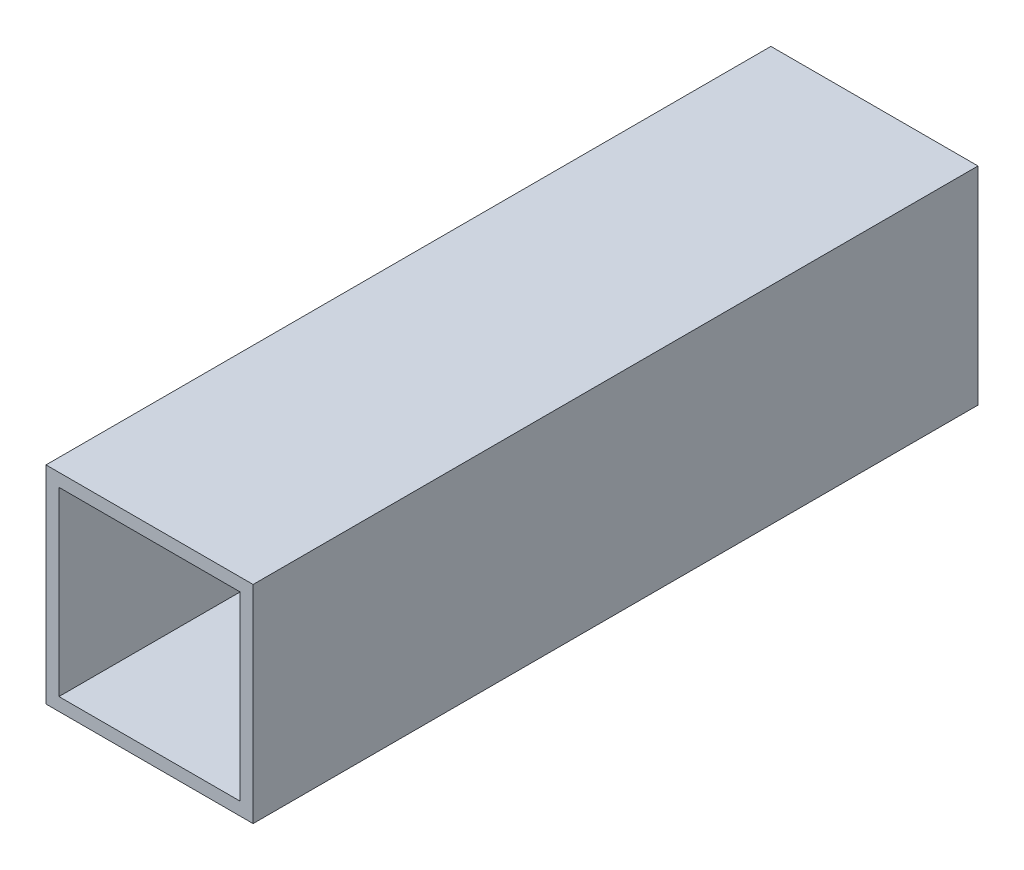
ISO-10303-21;
HEADER;
FILE_DESCRIPTION(('STEP AP214'),'2;1');
FILE_NAME('part.step','',(''),(''),'','','');
FILE_SCHEMA(('AUTOMOTIVE_DESIGN { 1 0 10303 214 1 1 1 1 }'));
ENDSEC;
DATA;
#1=APPLICATION_CONTEXT('core data for automotive mechanical design processes');
#2=APPLICATION_PROTOCOL_DEFINITION('international standard','automotive_design',2000,#1);
#3=PRODUCT_CONTEXT('',#1,'mechanical');
#4=PRODUCT('Part','Part','',(#3));
#5=PRODUCT_RELATED_PRODUCT_CATEGORY('part','',(#4));
#6=PRODUCT_DEFINITION_FORMATION('','',#4);
#7=PRODUCT_DEFINITION_CONTEXT('part definition',#1,'design');
#8=PRODUCT_DEFINITION('design','',#6,#7);
#9=PRODUCT_DEFINITION_SHAPE('','',#8);
#10=(LENGTH_UNIT() NAMED_UNIT(*) SI_UNIT(.MILLI.,.METRE.));
#11=(NAMED_UNIT(*) PLANE_ANGLE_UNIT() SI_UNIT($,.RADIAN.));
#12=(NAMED_UNIT(*) SI_UNIT($,.STERADIAN.) SOLID_ANGLE_UNIT());
#13=UNCERTAINTY_MEASURE_WITH_UNIT(LENGTH_MEASURE(1.E-05),#10,'distance_accuracy_value','');
#14=(GEOMETRIC_REPRESENTATION_CONTEXT(3) GLOBAL_UNCERTAINTY_ASSIGNED_CONTEXT((#13)) GLOBAL_UNIT_ASSIGNED_CONTEXT((#10,
#11,#12)) REPRESENTATION_CONTEXT('',''));
#15=CARTESIAN_POINT('',(0.,0.,0.));
#16=DIRECTION('',(0.,0.,1.));
#17=DIRECTION('',(1.,0.,0.));
#18=AXIS2_PLACEMENT_3D('',#15,#16,#17);
#19=CARTESIAN_POINT('',(0.,0.,177.8));
#20=DIRECTION('',(0.,0.,-1.));
#21=DIRECTION('',(-1.,0.,0.));
#22=AXIS2_PLACEMENT_3D('',#19,#20,#21);
#23=PLANE('',#22);
#24=DIRECTION('',(0.,-1.,0.));
#25=VECTOR('',#24,1.);
#26=CARTESIAN_POINT('',(0.,0.,177.8));
#27=LINE('',#26,#25);
#28=CARTESIAN_POINT('',(0.,50.8,177.8));
#29=VERTEX_POINT('',#28);
#30=CARTESIAN_POINT('',(0.,0.,177.8));
#31=VERTEX_POINT('',#30);
#32=EDGE_CURVE('E137',#29,#31,#27,.T.);
#33=ORIENTED_EDGE('',*,*,#32,.T.);
#34=DIRECTION('',(1.,0.,0.));
#35=VECTOR('',#34,1.);
#36=CARTESIAN_POINT('',(0.,0.,177.8));
#37=LINE('',#36,#35);
#38=CARTESIAN_POINT('',(50.8,0.,177.8));
#39=VERTEX_POINT('',#38);
#40=EDGE_CURVE('E140',#31,#39,#37,.T.);
#41=ORIENTED_EDGE('',*,*,#40,.T.);
#42=DIRECTION('',(0.,1.,0.));
#43=VECTOR('',#42,1.);
#44=CARTESIAN_POINT('',(50.8,0.,177.8));
#45=LINE('',#44,#43);
#46=CARTESIAN_POINT('',(50.8,50.8,177.8));
#47=VERTEX_POINT('',#46);
#48=EDGE_CURVE('E143',#39,#47,#45,.T.);
#49=ORIENTED_EDGE('',*,*,#48,.T.);
#50=DIRECTION('',(-1.,0.,0.));
#51=VECTOR('',#50,1.);
#52=CARTESIAN_POINT('',(0.,50.8,177.8));
#53=LINE('',#52,#51);
#54=EDGE_CURVE('E145',#47,#29,#53,.T.);
#55=ORIENTED_EDGE('',*,*,#54,.T.);
#56=EDGE_LOOP('',(#33,#41,#49,#55));
#57=FACE_BOUND('',#56,.T.);
#58=DIRECTION('',(1.,0.,0.));
#59=VECTOR('',#58,1.);
#60=CARTESIAN_POINT('',(3.175,3.175,177.8));
#61=LINE('',#60,#59);
#62=CARTESIAN_POINT('',(3.175,3.175,177.8));
#63=VERTEX_POINT('',#62);
#64=CARTESIAN_POINT('',(47.625,3.175,177.8));
#65=VERTEX_POINT('',#64);
#66=EDGE_CURVE('E101',#63,#65,#61,.T.);
#67=ORIENTED_EDGE('',*,*,#66,.F.);
#68=DIRECTION('',(0.,-1.,0.));
#69=VECTOR('',#68,1.);
#70=CARTESIAN_POINT('',(3.175,3.175,177.8));
#71=LINE('',#70,#69);
#72=CARTESIAN_POINT('',(3.175,47.625,177.8));
#73=VERTEX_POINT('',#72);
#74=EDGE_CURVE('E123',#73,#63,#71,.T.);
#75=ORIENTED_EDGE('',*,*,#74,.F.);
#76=DIRECTION('',(-1.,0.,0.));
#77=VECTOR('',#76,1.);
#78=CARTESIAN_POINT('',(3.175,47.625,177.8));
#79=LINE('',#78,#77);
#80=CARTESIAN_POINT('',(47.625,47.625,177.8));
#81=VERTEX_POINT('',#80);
#82=EDGE_CURVE('E121',#81,#73,#79,.T.);
#83=ORIENTED_EDGE('',*,*,#82,.F.);
#84=DIRECTION('',(0.,1.,0.));
#85=VECTOR('',#84,1.);
#86=CARTESIAN_POINT('',(47.625,3.175,177.8));
#87=LINE('',#86,#85);
#88=EDGE_CURVE('E109',#65,#81,#87,.T.);
#89=ORIENTED_EDGE('',*,*,#88,.F.);
#90=EDGE_LOOP('',(#67,#75,#83,#89));
#91=FACE_BOUND('',#90,.T.);
#92=ADVANCED_FACE('F36',(#57,#91),#23,.F.);
#93=CARTESIAN_POINT('',(0.,0.,0.));
#94=DIRECTION('',(0.,0.,-1.));
#95=DIRECTION('',(-1.,0.,0.));
#96=AXIS2_PLACEMENT_3D('',#93,#94,#95);
#97=PLANE('',#96);
#98=DIRECTION('',(0.,-1.,0.));
#99=VECTOR('',#98,1.);
#100=CARTESIAN_POINT('',(0.,0.,0.));
#101=LINE('',#100,#99);
#102=CARTESIAN_POINT('',(0.,50.8,0.));
#103=VERTEX_POINT('',#102);
#104=CARTESIAN_POINT('',(0.,0.,0.));
#105=VERTEX_POINT('',#104);
#106=EDGE_CURVE('E117',#103,#105,#101,.T.);
#107=ORIENTED_EDGE('',*,*,#106,.F.);
#108=DIRECTION('',(-1.,0.,0.));
#109=VECTOR('',#108,1.);
#110=CARTESIAN_POINT('',(0.,50.8,0.));
#111=LINE('',#110,#109);
#112=CARTESIAN_POINT('',(50.8,50.8,0.));
#113=VERTEX_POINT('',#112);
#114=EDGE_CURVE('E141',#113,#103,#111,.T.);
#115=ORIENTED_EDGE('',*,*,#114,.F.);
#116=DIRECTION('',(0.,1.,0.));
#117=VECTOR('',#116,1.);
#118=CARTESIAN_POINT('',(50.8,0.,0.));
#119=LINE('',#118,#117);
#120=CARTESIAN_POINT('',(50.8,0.,0.));
#121=VERTEX_POINT('',#120);
#122=EDGE_CURVE('E152',#121,#113,#119,.T.);
#123=ORIENTED_EDGE('',*,*,#122,.F.);
#124=DIRECTION('',(1.,0.,0.));
#125=VECTOR('',#124,1.);
#126=CARTESIAN_POINT('',(0.,0.,0.));
#127=LINE('',#126,#125);
#128=EDGE_CURVE('E150',#105,#121,#127,.T.);
#129=ORIENTED_EDGE('',*,*,#128,.F.);
#130=EDGE_LOOP('',(#107,#115,#123,#129));
#131=FACE_BOUND('',#130,.T.);
#132=DIRECTION('',(0.,-1.,0.));
#133=VECTOR('',#132,1.);
#134=CARTESIAN_POINT('',(3.175,3.175,0.));
#135=LINE('',#134,#133);
#136=CARTESIAN_POINT('',(3.175,47.625,0.));
#137=VERTEX_POINT('',#136);
#138=CARTESIAN_POINT('',(3.175,3.175,0.));
#139=VERTEX_POINT('',#138);
#140=EDGE_CURVE('E110',#137,#139,#135,.T.);
#141=ORIENTED_EDGE('',*,*,#140,.T.);
#142=DIRECTION('',(1.,0.,0.));
#143=VECTOR('',#142,1.);
#144=CARTESIAN_POINT('',(3.175,3.175,0.));
#145=LINE('',#144,#143);
#146=CARTESIAN_POINT('',(47.625,3.175,0.));
#147=VERTEX_POINT('',#146);
#148=EDGE_CURVE('E59',#139,#147,#145,.T.);
#149=ORIENTED_EDGE('',*,*,#148,.T.);
#150=DIRECTION('',(0.,1.,0.));
#151=VECTOR('',#150,1.);
#152=CARTESIAN_POINT('',(47.625,3.175,0.));
#153=LINE('',#152,#151);
#154=CARTESIAN_POINT('',(47.625,47.625,0.));
#155=VERTEX_POINT('',#154);
#156=EDGE_CURVE('E116',#147,#155,#153,.T.);
#157=ORIENTED_EDGE('',*,*,#156,.T.);
#158=DIRECTION('',(-1.,0.,0.));
#159=VECTOR('',#158,1.);
#160=CARTESIAN_POINT('',(3.175,47.625,0.));
#161=LINE('',#160,#159);
#162=EDGE_CURVE('E129',#155,#137,#161,.T.);
#163=ORIENTED_EDGE('',*,*,#162,.T.);
#164=EDGE_LOOP('',(#141,#149,#157,#163));
#165=FACE_BOUND('',#164,.T.);
#166=ADVANCED_FACE('F170',(#131,#165),#97,.T.);
#167=CARTESIAN_POINT('',(0.,0.,177.8));
#168=DIRECTION('',(1.,0.,0.));
#169=DIRECTION('',(0.,1.,0.));
#170=AXIS2_PLACEMENT_3D('',#167,#168,#169);
#171=PLANE('',#170);
#172=ORIENTED_EDGE('',*,*,#106,.T.);
#173=DIRECTION('',(0.,0.,-1.));
#174=VECTOR('',#173,1.);
#175=CARTESIAN_POINT('',(0.,0.,177.8));
#176=LINE('',#175,#174);
#177=EDGE_CURVE('E11',#31,#105,#176,.T.);
#178=ORIENTED_EDGE('',*,*,#177,.F.);
#179=ORIENTED_EDGE('',*,*,#32,.F.);
#180=DIRECTION('',(0.,0.,-1.));
#181=VECTOR('',#180,1.);
#182=CARTESIAN_POINT('',(0.,50.8,177.8));
#183=LINE('',#182,#181);
#184=EDGE_CURVE('E147',#29,#103,#183,.T.);
#185=ORIENTED_EDGE('',*,*,#184,.T.);
#186=EDGE_LOOP('',(#172,#178,#179,#185));
#187=FACE_BOUND('',#186,.T.);
#188=ADVANCED_FACE('F38',(#187),#171,.F.);
#189=CARTESIAN_POINT('',(0.,0.,177.8));
#190=DIRECTION('',(0.,1.,0.));
#191=DIRECTION('',(0.,0.,1.));
#192=AXIS2_PLACEMENT_3D('',#189,#190,#191);
#193=PLANE('',#192);
#194=ORIENTED_EDGE('',*,*,#128,.T.);
#195=DIRECTION('',(0.,0.,-1.));
#196=VECTOR('',#195,1.);
#197=CARTESIAN_POINT('',(50.8,0.,177.8));
#198=LINE('',#197,#196);
#199=EDGE_CURVE('E44',#39,#121,#198,.T.);
#200=ORIENTED_EDGE('',*,*,#199,.F.);
#201=ORIENTED_EDGE('',*,*,#40,.F.);
#202=ORIENTED_EDGE('',*,*,#177,.T.);
#203=EDGE_LOOP('',(#194,#200,#201,#202));
#204=FACE_BOUND('',#203,.T.);
#205=ADVANCED_FACE('F180',(#204),#193,.F.);
#206=CARTESIAN_POINT('',(50.8,0.,177.8));
#207=DIRECTION('',(-1.,0.,0.));
#208=DIRECTION('',(0.,-1.,0.));
#209=AXIS2_PLACEMENT_3D('',#206,#207,#208);
#210=PLANE('',#209);
#211=ORIENTED_EDGE('',*,*,#122,.T.);
#212=DIRECTION('',(0.,0.,-1.));
#213=VECTOR('',#212,1.);
#214=CARTESIAN_POINT('',(50.8,50.8,177.8));
#215=LINE('',#214,#213);
#216=EDGE_CURVE('E157',#47,#113,#215,.T.);
#217=ORIENTED_EDGE('',*,*,#216,.F.);
#218=ORIENTED_EDGE('',*,*,#48,.F.);
#219=ORIENTED_EDGE('',*,*,#199,.T.);
#220=EDGE_LOOP('',(#211,#217,#218,#219));
#221=FACE_BOUND('',#220,.T.);
#222=ADVANCED_FACE('F164',(#221),#210,.F.);
#223=CARTESIAN_POINT('',(0.,50.8,177.8));
#224=DIRECTION('',(0.,-1.,0.));
#225=DIRECTION('',(0.,0.,-1.));
#226=AXIS2_PLACEMENT_3D('',#223,#224,#225);
#227=PLANE('',#226);
#228=ORIENTED_EDGE('',*,*,#114,.T.);
#229=ORIENTED_EDGE('',*,*,#184,.F.);
#230=ORIENTED_EDGE('',*,*,#54,.F.);
#231=ORIENTED_EDGE('',*,*,#216,.T.);
#232=EDGE_LOOP('',(#228,#229,#230,#231));
#233=FACE_BOUND('',#232,.T.);
#234=ADVANCED_FACE('F174',(#233),#227,.F.);
#235=CARTESIAN_POINT('',(3.175,3.175,177.8));
#236=DIRECTION('',(0.,1.,0.));
#237=DIRECTION('',(0.,0.,1.));
#238=AXIS2_PLACEMENT_3D('',#235,#236,#237);
#239=PLANE('',#238);
#240=ORIENTED_EDGE('',*,*,#148,.F.);
#241=DIRECTION('',(0.,0.,-1.));
#242=VECTOR('',#241,1.);
#243=CARTESIAN_POINT('',(3.175,3.175,177.8));
#244=LINE('',#243,#242);
#245=EDGE_CURVE('E105',#63,#139,#244,.T.);
#246=ORIENTED_EDGE('',*,*,#245,.F.);
#247=ORIENTED_EDGE('',*,*,#66,.T.);
#248=DIRECTION('',(0.,0.,-1.));
#249=VECTOR('',#248,1.);
#250=CARTESIAN_POINT('',(47.625,3.175,177.8));
#251=LINE('',#250,#249);
#252=EDGE_CURVE('E104',#65,#147,#251,.T.);
#253=ORIENTED_EDGE('',*,*,#252,.T.);
#254=EDGE_LOOP('',(#240,#246,#247,#253));
#255=FACE_BOUND('',#254,.T.);
#256=ADVANCED_FACE('F103',(#255),#239,.T.);
#257=CARTESIAN_POINT('',(47.625,3.175,177.8));
#258=DIRECTION('',(-1.,0.,0.));
#259=DIRECTION('',(0.,0.,1.));
#260=AXIS2_PLACEMENT_3D('',#257,#258,#259);
#261=PLANE('',#260);
#262=ORIENTED_EDGE('',*,*,#156,.F.);
#263=ORIENTED_EDGE('',*,*,#252,.F.);
#264=ORIENTED_EDGE('',*,*,#88,.T.);
#265=DIRECTION('',(0.,0.,-1.));
#266=VECTOR('',#265,1.);
#267=CARTESIAN_POINT('',(47.625,47.625,177.8));
#268=LINE('',#267,#266);
#269=EDGE_CURVE('E118',#81,#155,#268,.T.);
#270=ORIENTED_EDGE('',*,*,#269,.T.);
#271=EDGE_LOOP('',(#262,#263,#264,#270));
#272=FACE_BOUND('',#271,.T.);
#273=ADVANCED_FACE('F113',(#272),#261,.T.);
#274=CARTESIAN_POINT('',(3.175,47.625,177.8));
#275=DIRECTION('',(0.,-1.,0.));
#276=DIRECTION('',(0.,0.,-1.));
#277=AXIS2_PLACEMENT_3D('',#274,#275,#276);
#278=PLANE('',#277);
#279=ORIENTED_EDGE('',*,*,#162,.F.);
#280=ORIENTED_EDGE('',*,*,#269,.F.);
#281=ORIENTED_EDGE('',*,*,#82,.T.);
#282=DIRECTION('',(0.,0.,-1.));
#283=VECTOR('',#282,1.);
#284=CARTESIAN_POINT('',(3.175,47.625,177.8));
#285=LINE('',#284,#283);
#286=EDGE_CURVE('E51',#73,#137,#285,.T.);
#287=ORIENTED_EDGE('',*,*,#286,.T.);
#288=EDGE_LOOP('',(#279,#280,#281,#287));
#289=FACE_BOUND('',#288,.T.);
#290=ADVANCED_FACE('F203',(#289),#278,.T.);
#291=CARTESIAN_POINT('',(3.175,3.175,177.8));
#292=DIRECTION('',(1.,0.,0.));
#293=DIRECTION('',(0.,0.,-1.));
#294=AXIS2_PLACEMENT_3D('',#291,#292,#293);
#295=PLANE('',#294);
#296=ORIENTED_EDGE('',*,*,#140,.F.);
#297=ORIENTED_EDGE('',*,*,#286,.F.);
#298=ORIENTED_EDGE('',*,*,#74,.T.);
#299=ORIENTED_EDGE('',*,*,#245,.T.);
#300=EDGE_LOOP('',(#296,#297,#298,#299));
#301=FACE_BOUND('',#300,.T.);
#302=ADVANCED_FACE('F207',(#301),#295,.T.);
#303=CLOSED_SHELL('',(#92,#166,#188,#205,#222,#234,#256,#273,#290,#302));
#304=MANIFOLD_SOLID_BREP('B2',#303);
#305=ADVANCED_BREP_SHAPE_REPRESENTATION('',(#18,#304),#14);
#306=SHAPE_DEFINITION_REPRESENTATION(#9,#305);
ENDSEC;
END-ISO-10303-21;
